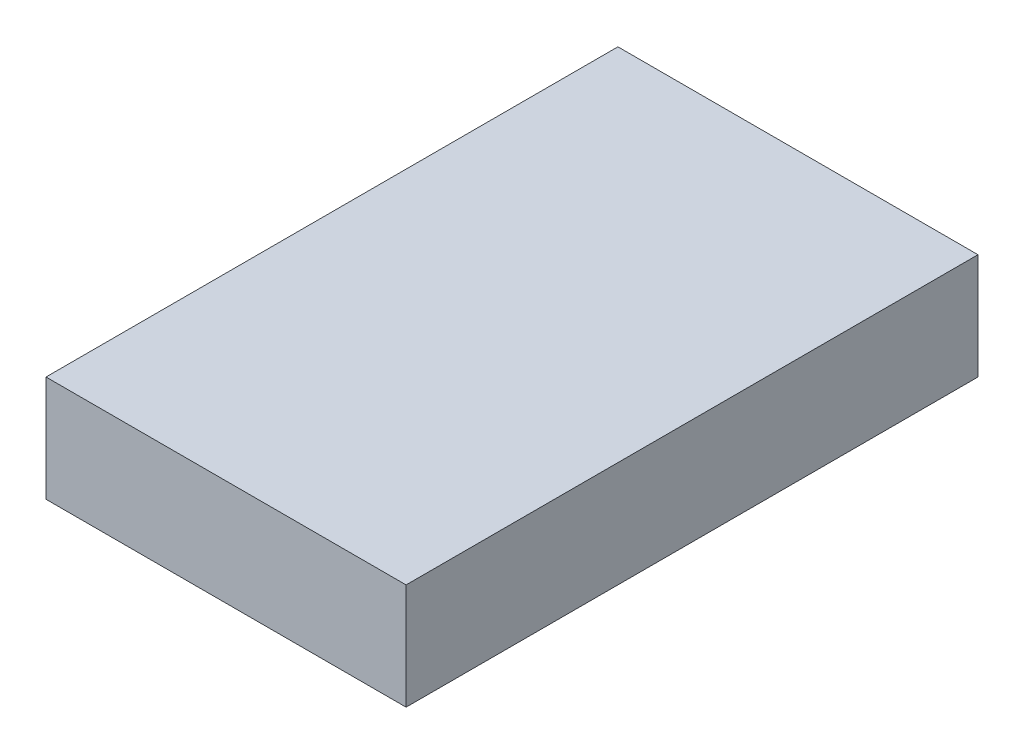
ISO-10303-21;
HEADER;
FILE_DESCRIPTION(('STEP AP214'),'2;1');
FILE_NAME('part.step','',(''),(''),'','','');
FILE_SCHEMA(('AUTOMOTIVE_DESIGN { 1 0 10303 214 1 1 1 1 }'));
ENDSEC;
DATA;
#1=APPLICATION_CONTEXT('core data for automotive mechanical design processes');
#2=APPLICATION_PROTOCOL_DEFINITION('international standard','automotive_design',2000,#1);
#3=PRODUCT_CONTEXT('',#1,'mechanical');
#4=PRODUCT('Part','Part','',(#3));
#5=PRODUCT_RELATED_PRODUCT_CATEGORY('part','',(#4));
#6=PRODUCT_DEFINITION_FORMATION('','',#4);
#7=PRODUCT_DEFINITION_CONTEXT('part definition',#1,'design');
#8=PRODUCT_DEFINITION('design','',#6,#7);
#9=PRODUCT_DEFINITION_SHAPE('','',#8);
#10=(LENGTH_UNIT() NAMED_UNIT(*) SI_UNIT(.MILLI.,.METRE.));
#11=(NAMED_UNIT(*) PLANE_ANGLE_UNIT() SI_UNIT($,.RADIAN.));
#12=(NAMED_UNIT(*) SI_UNIT($,.STERADIAN.) SOLID_ANGLE_UNIT());
#13=UNCERTAINTY_MEASURE_WITH_UNIT(LENGTH_MEASURE(1.E-05),#10,'distance_accuracy_value','');
#14=(GEOMETRIC_REPRESENTATION_CONTEXT(3) GLOBAL_UNCERTAINTY_ASSIGNED_CONTEXT((#13)) GLOBAL_UNIT_ASSIGNED_CONTEXT((#10,
#11,#12)) REPRESENTATION_CONTEXT('',''));
#15=CARTESIAN_POINT('',(0.,0.,0.));
#16=DIRECTION('',(0.,0.,1.));
#17=DIRECTION('',(1.,0.,0.));
#18=AXIS2_PLACEMENT_3D('',#15,#16,#17);
#19=CARTESIAN_POINT('',(0.,0.,0.));
#20=DIRECTION('',(0.,1.,0.));
#21=DIRECTION('',(0.,0.,1.));
#22=AXIS2_PLACEMENT_3D('',#19,#20,#21);
#23=PLANE('',#22);
#24=DIRECTION('',(1.,0.,0.));
#25=VECTOR('',#24,1.);
#26=CARTESIAN_POINT('',(0.,0.,1.08));
#27=LINE('',#26,#25);
#28=CARTESIAN_POINT('',(-0.68,0.,1.08));
#29=VERTEX_POINT('',#28);
#30=CARTESIAN_POINT('',(0.68,0.,1.08));
#31=VERTEX_POINT('',#30);
#32=EDGE_CURVE('E20',#29,#31,#27,.T.);
#33=ORIENTED_EDGE('',*,*,#32,.F.);
#34=DIRECTION('',(0.,0.,-1.));
#35=VECTOR('',#34,1.);
#36=CARTESIAN_POINT('',(-0.68,0.,-1.08));
#37=LINE('',#36,#35);
#38=CARTESIAN_POINT('',(-0.68,0.,-1.08));
#39=VERTEX_POINT('',#38);
#40=EDGE_CURVE('E69',#29,#39,#37,.T.);
#41=ORIENTED_EDGE('',*,*,#40,.T.);
#42=DIRECTION('',(1.,0.,0.));
#43=VECTOR('',#42,1.);
#44=CARTESIAN_POINT('',(-0.68,0.,-1.08));
#45=LINE('',#44,#43);
#46=CARTESIAN_POINT('',(0.68,0.,-1.08));
#47=VERTEX_POINT('',#46);
#48=EDGE_CURVE('E56',#39,#47,#45,.T.);
#49=ORIENTED_EDGE('',*,*,#48,.T.);
#50=DIRECTION('',(0.,0.,1.));
#51=VECTOR('',#50,1.);
#52=CARTESIAN_POINT('',(0.68,0.,-1.08));
#53=LINE('',#52,#51);
#54=EDGE_CURVE('E62',#47,#31,#53,.T.);
#55=ORIENTED_EDGE('',*,*,#54,.T.);
#56=EDGE_LOOP('',(#33,#41,#49,#55));
#57=FACE_BOUND('',#56,.T.);
#58=ADVANCED_FACE('F17',(#57),#23,.F.);
#59=CARTESIAN_POINT('',(0.68,0.4,-1.08));
#60=DIRECTION('',(-1.,0.,0.));
#61=DIRECTION('',(0.,0.,1.));
#62=AXIS2_PLACEMENT_3D('',#59,#60,#61);
#63=PLANE('',#62);
#64=DIRECTION('',(0.,1.,0.));
#65=VECTOR('',#64,1.);
#66=CARTESIAN_POINT('',(0.68,0.4,-1.08));
#67=LINE('',#66,#65);
#68=CARTESIAN_POINT('',(0.68,0.4,-1.08));
#69=VERTEX_POINT('',#68);
#70=EDGE_CURVE('E64',#47,#69,#67,.T.);
#71=ORIENTED_EDGE('',*,*,#70,.T.);
#72=DIRECTION('',(0.,0.,1.));
#73=VECTOR('',#72,1.);
#74=CARTESIAN_POINT('',(0.68,0.4,0.));
#75=LINE('',#74,#73);
#76=CARTESIAN_POINT('',(0.68,0.4,1.08));
#77=VERTEX_POINT('',#76);
#78=EDGE_CURVE('E83',#77,#69,#75,.F.);
#79=ORIENTED_EDGE('',*,*,#78,.F.);
#80=DIRECTION('',(0.,1.,0.));
#81=VECTOR('',#80,1.);
#82=CARTESIAN_POINT('',(0.68,0.4,1.08));
#83=LINE('',#82,#81);
#84=EDGE_CURVE('E67',#77,#31,#83,.F.);
#85=ORIENTED_EDGE('',*,*,#84,.T.);
#86=ORIENTED_EDGE('',*,*,#54,.F.);
#87=EDGE_LOOP('',(#71,#79,#85,#86));
#88=FACE_BOUND('',#87,.T.);
#89=ADVANCED_FACE('F63',(#88),#63,.F.);
#90=CARTESIAN_POINT('',(-0.68,0.4,-1.08));
#91=DIRECTION('',(0.,0.,1.));
#92=DIRECTION('',(1.,0.,0.));
#93=AXIS2_PLACEMENT_3D('',#90,#91,#92);
#94=PLANE('',#93);
#95=DIRECTION('',(0.,1.,0.));
#96=VECTOR('',#95,1.);
#97=CARTESIAN_POINT('',(-0.68,0.4,-1.08));
#98=LINE('',#97,#96);
#99=CARTESIAN_POINT('',(-0.68,0.4,-1.08));
#100=VERTEX_POINT('',#99);
#101=EDGE_CURVE('E71',#39,#100,#98,.T.);
#102=ORIENTED_EDGE('',*,*,#101,.T.);
#103=DIRECTION('',(1.,0.,0.));
#104=VECTOR('',#103,1.);
#105=CARTESIAN_POINT('',(0.,0.4,-1.08));
#106=LINE('',#105,#104);
#107=EDGE_CURVE('E75',#69,#100,#106,.F.);
#108=ORIENTED_EDGE('',*,*,#107,.F.);
#109=ORIENTED_EDGE('',*,*,#70,.F.);
#110=ORIENTED_EDGE('',*,*,#48,.F.);
#111=EDGE_LOOP('',(#102,#108,#109,#110));
#112=FACE_BOUND('',#111,.T.);
#113=ADVANCED_FACE('F73',(#112),#94,.F.);
#114=CARTESIAN_POINT('',(-0.68,0.4,-1.08));
#115=DIRECTION('',(1.,0.,0.));
#116=DIRECTION('',(0.,0.,-1.));
#117=AXIS2_PLACEMENT_3D('',#114,#115,#116);
#118=PLANE('',#117);
#119=DIRECTION('',(0.,1.,0.));
#120=VECTOR('',#119,1.);
#121=CARTESIAN_POINT('',(-0.68,0.4,1.08));
#122=LINE('',#121,#120);
#123=CARTESIAN_POINT('',(-0.68,0.4,1.08));
#124=VERTEX_POINT('',#123);
#125=EDGE_CURVE('E35',#29,#124,#122,.T.);
#126=ORIENTED_EDGE('',*,*,#125,.T.);
#127=DIRECTION('',(0.,0.,1.));
#128=VECTOR('',#127,1.);
#129=CARTESIAN_POINT('',(-0.68,0.4,0.));
#130=LINE('',#129,#128);
#131=EDGE_CURVE('E26',#100,#124,#130,.T.);
#132=ORIENTED_EDGE('',*,*,#131,.F.);
#133=ORIENTED_EDGE('',*,*,#101,.F.);
#134=ORIENTED_EDGE('',*,*,#40,.F.);
#135=EDGE_LOOP('',(#126,#132,#133,#134));
#136=FACE_BOUND('',#135,.T.);
#137=ADVANCED_FACE('F89',(#136),#118,.F.);
#138=CARTESIAN_POINT('',(-0.68,0.4,1.08));
#139=DIRECTION('',(0.,0.,-1.));
#140=DIRECTION('',(-1.,0.,0.));
#141=AXIS2_PLACEMENT_3D('',#138,#139,#140);
#142=PLANE('',#141);
#143=ORIENTED_EDGE('',*,*,#84,.F.);
#144=DIRECTION('',(1.,0.,0.));
#145=VECTOR('',#144,1.);
#146=CARTESIAN_POINT('',(0.,0.4,1.08));
#147=LINE('',#146,#145);
#148=EDGE_CURVE('E11',#124,#77,#147,.T.);
#149=ORIENTED_EDGE('',*,*,#148,.F.);
#150=ORIENTED_EDGE('',*,*,#125,.F.);
#151=ORIENTED_EDGE('',*,*,#32,.T.);
#152=EDGE_LOOP('',(#143,#149,#150,#151));
#153=FACE_BOUND('',#152,.T.);
#154=ADVANCED_FACE('F91',(#153),#142,.F.);
#155=CARTESIAN_POINT('',(0.,0.4,0.));
#156=DIRECTION('',(0.,1.,0.));
#157=DIRECTION('',(0.,0.,1.));
#158=AXIS2_PLACEMENT_3D('',#155,#156,#157);
#159=PLANE('',#158);
#160=ORIENTED_EDGE('',*,*,#131,.T.);
#161=ORIENTED_EDGE('',*,*,#148,.T.);
#162=ORIENTED_EDGE('',*,*,#78,.T.);
#163=ORIENTED_EDGE('',*,*,#107,.T.);
#164=EDGE_LOOP('',(#160,#161,#162,#163));
#165=FACE_BOUND('',#164,.T.);
#166=ADVANCED_FACE('F88',(#165),#159,.T.);
#167=CLOSED_SHELL('',(#58,#89,#113,#137,#154,#166));
#168=MANIFOLD_SOLID_BREP('B1',#167);
#169=ADVANCED_BREP_SHAPE_REPRESENTATION('',(#18,#168),#14);
#170=SHAPE_DEFINITION_REPRESENTATION(#9,#169);
ENDSEC;
END-ISO-10303-21;
